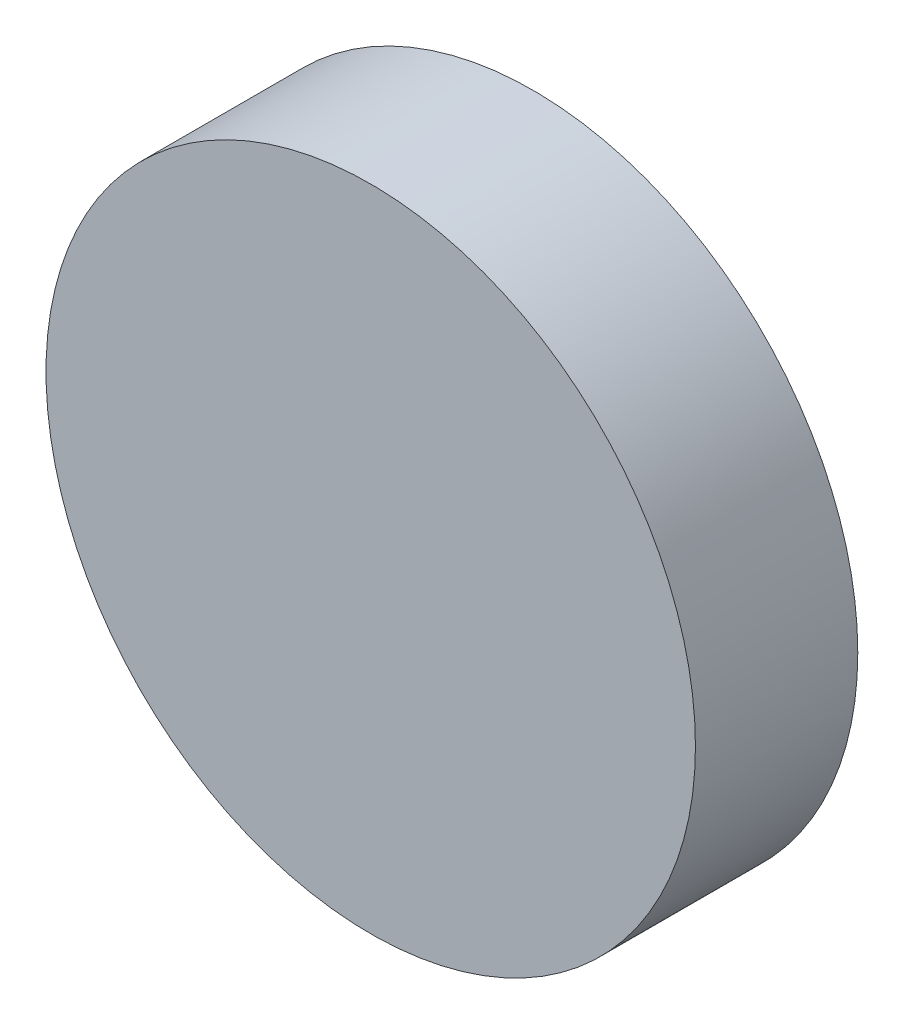
ISO-10303-21;
HEADER;
FILE_DESCRIPTION(('STEP AP214'),'2;1');
FILE_NAME('part.step','',(''),(''),'','','');
FILE_SCHEMA(('AUTOMOTIVE_DESIGN { 1 0 10303 214 1 1 1 1 }'));
ENDSEC;
DATA;
#1=APPLICATION_CONTEXT('core data for automotive mechanical design processes');
#2=APPLICATION_PROTOCOL_DEFINITION('international standard','automotive_design',2000,#1);
#3=PRODUCT_CONTEXT('',#1,'mechanical');
#4=PRODUCT('Part','Part','',(#3));
#5=PRODUCT_RELATED_PRODUCT_CATEGORY('part','',(#4));
#6=PRODUCT_DEFINITION_FORMATION('','',#4);
#7=PRODUCT_DEFINITION_CONTEXT('part definition',#1,'design');
#8=PRODUCT_DEFINITION('design','',#6,#7);
#9=PRODUCT_DEFINITION_SHAPE('','',#8);
#10=(LENGTH_UNIT() NAMED_UNIT(*) SI_UNIT(.MILLI.,.METRE.));
#11=(NAMED_UNIT(*) PLANE_ANGLE_UNIT() SI_UNIT($,.RADIAN.));
#12=(NAMED_UNIT(*) SI_UNIT($,.STERADIAN.) SOLID_ANGLE_UNIT());
#13=UNCERTAINTY_MEASURE_WITH_UNIT(LENGTH_MEASURE(1.E-05),#10,'distance_accuracy_value','');
#14=(GEOMETRIC_REPRESENTATION_CONTEXT(3) GLOBAL_UNCERTAINTY_ASSIGNED_CONTEXT((#13)) GLOBAL_UNIT_ASSIGNED_CONTEXT((#10,
#11,#12)) REPRESENTATION_CONTEXT('',''));
#15=CARTESIAN_POINT('',(0.,0.,0.));
#16=DIRECTION('',(0.,0.,1.));
#17=DIRECTION('',(1.,0.,0.));
#18=AXIS2_PLACEMENT_3D('',#15,#16,#17);
#19=CARTESIAN_POINT('',(0.,0.,0.4));
#20=DIRECTION('',(0.,0.,-1.));
#21=DIRECTION('',(-1.,0.,0.));
#22=AXIS2_PLACEMENT_3D('',#19,#20,#21);
#23=CYLINDRICAL_SURFACE('',#22,0.8);
#24=CARTESIAN_POINT('',(0.,0.,0.4));
#25=DIRECTION('',(0.,0.,1.));
#26=DIRECTION('',(1.,0.,0.));
#27=AXIS2_PLACEMENT_3D('',#24,#25,#26);
#28=CIRCLE('',#27,0.8);
#29=CARTESIAN_POINT('',(0.8,0.,0.4));
#30=VERTEX_POINT('',#29);
#31=EDGE_CURVE('E10',#30,#30,#28,.T.);
#32=ORIENTED_EDGE('',*,*,#31,.F.);
#33=EDGE_LOOP('',(#32));
#34=FACE_BOUND('',#33,.T.);
#35=CARTESIAN_POINT('',(0.,0.,0.));
#36=DIRECTION('',(0.,0.,1.));
#37=DIRECTION('',(1.,0.,0.));
#38=AXIS2_PLACEMENT_3D('',#35,#36,#37);
#39=CIRCLE('',#38,0.8);
#40=CARTESIAN_POINT('',(0.8,0.,0.));
#41=VERTEX_POINT('',#40);
#42=EDGE_CURVE('E44',#41,#41,#39,.T.);
#43=ORIENTED_EDGE('',*,*,#42,.T.);
#44=EDGE_LOOP('',(#43));
#45=FACE_BOUND('',#44,.T.);
#46=ADVANCED_FACE('F41',(#34,#45),#23,.T.);
#47=CARTESIAN_POINT('',(0.,0.,0.4));
#48=DIRECTION('',(0.,0.,1.));
#49=DIRECTION('',(1.,0.,0.));
#50=AXIS2_PLACEMENT_3D('',#47,#48,#49);
#51=PLANE('',#50);
#52=ORIENTED_EDGE('',*,*,#31,.T.);
#53=EDGE_LOOP('',(#52));
#54=FACE_BOUND('',#53,.T.);
#55=ADVANCED_FACE('F58',(#54),#51,.T.);
#56=CARTESIAN_POINT('',(0.,0.,0.));
#57=DIRECTION('',(0.,0.,1.));
#58=DIRECTION('',(1.,0.,0.));
#59=AXIS2_PLACEMENT_3D('',#56,#57,#58);
#60=PLANE('',#59);
#61=ORIENTED_EDGE('',*,*,#42,.F.);
#62=EDGE_LOOP('',(#61));
#63=FACE_BOUND('',#62,.T.);
#64=ADVANCED_FACE('F56',(#63),#60,.F.);
#65=CLOSED_SHELL('',(#46,#55,#64));
#66=MANIFOLD_SOLID_BREP('B2',#65);
#67=ADVANCED_BREP_SHAPE_REPRESENTATION('',(#18,#66),#14);
#68=SHAPE_DEFINITION_REPRESENTATION(#9,#67);
ENDSEC;
END-ISO-10303-21;
